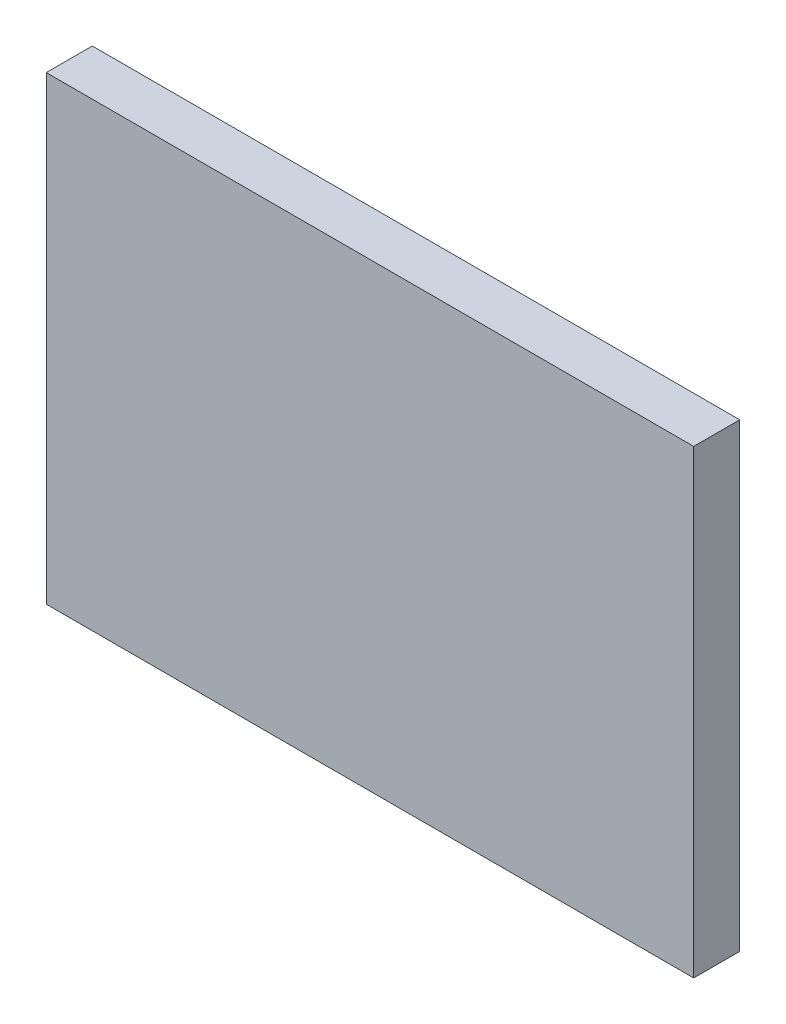
ISO-10303-21;
HEADER;
FILE_DESCRIPTION(('STEP AP214'),'2;1');
FILE_NAME('part.step','',(''),(''),'','','');
FILE_SCHEMA(('AUTOMOTIVE_DESIGN { 1 0 10303 214 1 1 1 1 }'));
ENDSEC;
DATA;
#1=APPLICATION_CONTEXT('core data for automotive mechanical design processes');
#2=APPLICATION_PROTOCOL_DEFINITION('international standard','automotive_design',2000,#1);
#3=PRODUCT_CONTEXT('',#1,'mechanical');
#4=PRODUCT('Part','Part','',(#3));
#5=PRODUCT_RELATED_PRODUCT_CATEGORY('part','',(#4));
#6=PRODUCT_DEFINITION_FORMATION('','',#4);
#7=PRODUCT_DEFINITION_CONTEXT('part definition',#1,'design');
#8=PRODUCT_DEFINITION('design','',#6,#7);
#9=PRODUCT_DEFINITION_SHAPE('','',#8);
#10=(LENGTH_UNIT() NAMED_UNIT(*) SI_UNIT(.MILLI.,.METRE.));
#11=(NAMED_UNIT(*) PLANE_ANGLE_UNIT() SI_UNIT($,.RADIAN.));
#12=(NAMED_UNIT(*) SI_UNIT($,.STERADIAN.) SOLID_ANGLE_UNIT());
#13=UNCERTAINTY_MEASURE_WITH_UNIT(LENGTH_MEASURE(1.E-05),#10,'distance_accuracy_value','');
#14=(GEOMETRIC_REPRESENTATION_CONTEXT(3) GLOBAL_UNCERTAINTY_ASSIGNED_CONTEXT((#13)) GLOBAL_UNIT_ASSIGNED_CONTEXT((#10,
#11,#12)) REPRESENTATION_CONTEXT('',''));
#15=CARTESIAN_POINT('',(0.,0.,0.));
#16=DIRECTION('',(0.,0.,1.));
#17=DIRECTION('',(1.,0.,0.));
#18=AXIS2_PLACEMENT_3D('',#15,#16,#17);
#19=CARTESIAN_POINT('',(11.25,8.,1.6));
#20=DIRECTION('',(-1.,0.,0.));
#21=DIRECTION('',(0.,-1.,0.));
#22=AXIS2_PLACEMENT_3D('',#19,#20,#21);
#23=PLANE('',#22);
#24=DIRECTION('',(0.,1.,0.));
#25=VECTOR('',#24,1.);
#26=CARTESIAN_POINT('',(11.25,8.,0.));
#27=LINE('',#26,#25);
#28=CARTESIAN_POINT('',(11.25,-8.,0.));
#29=VERTEX_POINT('',#28);
#30=CARTESIAN_POINT('',(11.25,8.,0.));
#31=VERTEX_POINT('',#30);
#32=EDGE_CURVE('E96',#29,#31,#27,.T.);
#33=ORIENTED_EDGE('',*,*,#32,.T.);
#34=DIRECTION('',(0.,0.,-1.));
#35=VECTOR('',#34,1.);
#36=CARTESIAN_POINT('',(11.25,8.,1.6));
#37=LINE('',#36,#35);
#38=CARTESIAN_POINT('',(11.25,8.,1.6));
#39=VERTEX_POINT('',#38);
#40=EDGE_CURVE('E11',#39,#31,#37,.T.);
#41=ORIENTED_EDGE('',*,*,#40,.F.);
#42=DIRECTION('',(0.,1.,0.));
#43=VECTOR('',#42,1.);
#44=CARTESIAN_POINT('',(11.25,8.,1.6));
#45=LINE('',#44,#43);
#46=CARTESIAN_POINT('',(11.25,-8.,1.6));
#47=VERTEX_POINT('',#46);
#48=EDGE_CURVE('E84',#47,#39,#45,.T.);
#49=ORIENTED_EDGE('',*,*,#48,.F.);
#50=DIRECTION('',(0.,0.,-1.));
#51=VECTOR('',#50,1.);
#52=CARTESIAN_POINT('',(11.25,-8.,1.6));
#53=LINE('',#52,#51);
#54=EDGE_CURVE('E92',#47,#29,#53,.T.);
#55=ORIENTED_EDGE('',*,*,#54,.T.);
#56=EDGE_LOOP('',(#33,#41,#49,#55));
#57=FACE_BOUND('',#56,.T.);
#58=ADVANCED_FACE('F33',(#57),#23,.F.);
#59=CARTESIAN_POINT('',(-11.25,8.,1.6));
#60=DIRECTION('',(0.,-1.,0.));
#61=DIRECTION('',(0.,0.,-1.));
#62=AXIS2_PLACEMENT_3D('',#59,#60,#61);
#63=PLANE('',#62);
#64=DIRECTION('',(-1.,0.,0.));
#65=VECTOR('',#64,1.);
#66=CARTESIAN_POINT('',(-11.25,8.,0.));
#67=LINE('',#66,#65);
#68=CARTESIAN_POINT('',(-11.25,8.,0.));
#69=VERTEX_POINT('',#68);
#70=EDGE_CURVE('E88',#31,#69,#67,.T.);
#71=ORIENTED_EDGE('',*,*,#70,.T.);
#72=DIRECTION('',(0.,0.,-1.));
#73=VECTOR('',#72,1.);
#74=CARTESIAN_POINT('',(-11.25,8.,1.6));
#75=LINE('',#74,#73);
#76=CARTESIAN_POINT('',(-11.25,8.,1.6));
#77=VERTEX_POINT('',#76);
#78=EDGE_CURVE('E41',#77,#69,#75,.T.);
#79=ORIENTED_EDGE('',*,*,#78,.F.);
#80=DIRECTION('',(-1.,0.,0.));
#81=VECTOR('',#80,1.);
#82=CARTESIAN_POINT('',(-11.25,8.,1.6));
#83=LINE('',#82,#81);
#84=EDGE_CURVE('E79',#39,#77,#83,.T.);
#85=ORIENTED_EDGE('',*,*,#84,.F.);
#86=ORIENTED_EDGE('',*,*,#40,.T.);
#87=EDGE_LOOP('',(#71,#79,#85,#86));
#88=FACE_BOUND('',#87,.T.);
#89=ADVANCED_FACE('F87',(#88),#63,.F.);
#90=CARTESIAN_POINT('',(-11.25,8.,1.6));
#91=DIRECTION('',(1.,0.,0.));
#92=DIRECTION('',(0.,1.,0.));
#93=AXIS2_PLACEMENT_3D('',#90,#91,#92);
#94=PLANE('',#93);
#95=DIRECTION('',(0.,-1.,0.));
#96=VECTOR('',#95,1.);
#97=CARTESIAN_POINT('',(-11.25,8.,0.));
#98=LINE('',#97,#96);
#99=CARTESIAN_POINT('',(-11.25,-8.,0.));
#100=VERTEX_POINT('',#99);
#101=EDGE_CURVE('E66',#69,#100,#98,.T.);
#102=ORIENTED_EDGE('',*,*,#101,.T.);
#103=DIRECTION('',(0.,0.,-1.));
#104=VECTOR('',#103,1.);
#105=CARTESIAN_POINT('',(-11.25,-8.,1.6));
#106=LINE('',#105,#104);
#107=CARTESIAN_POINT('',(-11.25,-8.,1.6));
#108=VERTEX_POINT('',#107);
#109=EDGE_CURVE('E89',#108,#100,#106,.T.);
#110=ORIENTED_EDGE('',*,*,#109,.F.);
#111=DIRECTION('',(0.,-1.,0.));
#112=VECTOR('',#111,1.);
#113=CARTESIAN_POINT('',(-11.25,8.,1.6));
#114=LINE('',#113,#112);
#115=EDGE_CURVE('E82',#77,#108,#114,.T.);
#116=ORIENTED_EDGE('',*,*,#115,.F.);
#117=ORIENTED_EDGE('',*,*,#78,.T.);
#118=EDGE_LOOP('',(#102,#110,#116,#117));
#119=FACE_BOUND('',#118,.T.);
#120=ADVANCED_FACE('F90',(#119),#94,.F.);
#121=CARTESIAN_POINT('',(-11.25,-8.,1.6));
#122=DIRECTION('',(0.,1.,0.));
#123=DIRECTION('',(0.,0.,1.));
#124=AXIS2_PLACEMENT_3D('',#121,#122,#123);
#125=PLANE('',#124);
#126=DIRECTION('',(1.,0.,0.));
#127=VECTOR('',#126,1.);
#128=CARTESIAN_POINT('',(-11.25,-8.,0.));
#129=LINE('',#128,#127);
#130=EDGE_CURVE('E72',#100,#29,#129,.T.);
#131=ORIENTED_EDGE('',*,*,#130,.T.);
#132=ORIENTED_EDGE('',*,*,#54,.F.);
#133=DIRECTION('',(1.,0.,0.));
#134=VECTOR('',#133,1.);
#135=CARTESIAN_POINT('',(-11.25,-8.,1.6));
#136=LINE('',#135,#134);
#137=EDGE_CURVE('E49',#108,#47,#136,.T.);
#138=ORIENTED_EDGE('',*,*,#137,.F.);
#139=ORIENTED_EDGE('',*,*,#109,.T.);
#140=EDGE_LOOP('',(#131,#132,#138,#139));
#141=FACE_BOUND('',#140,.T.);
#142=ADVANCED_FACE('F103',(#141),#125,.F.);
#143=CARTESIAN_POINT('',(0.,0.,1.6));
#144=DIRECTION('',(0.,0.,1.));
#145=DIRECTION('',(1.,0.,0.));
#146=AXIS2_PLACEMENT_3D('',#143,#144,#145);
#147=PLANE('',#146);
#148=ORIENTED_EDGE('',*,*,#48,.T.);
#149=ORIENTED_EDGE('',*,*,#84,.T.);
#150=ORIENTED_EDGE('',*,*,#115,.T.);
#151=ORIENTED_EDGE('',*,*,#137,.T.);
#152=EDGE_LOOP('',(#148,#149,#150,#151));
#153=FACE_BOUND('',#152,.T.);
#154=ADVANCED_FACE('F80',(#153),#147,.T.);
#155=CARTESIAN_POINT('',(0.,0.,0.));
#156=DIRECTION('',(0.,0.,1.));
#157=DIRECTION('',(1.,0.,0.));
#158=AXIS2_PLACEMENT_3D('',#155,#156,#157);
#159=PLANE('',#158);
#160=ORIENTED_EDGE('',*,*,#32,.F.);
#161=ORIENTED_EDGE('',*,*,#130,.F.);
#162=ORIENTED_EDGE('',*,*,#101,.F.);
#163=ORIENTED_EDGE('',*,*,#70,.F.);
#164=EDGE_LOOP('',(#160,#161,#162,#163));
#165=FACE_BOUND('',#164,.T.);
#166=ADVANCED_FACE('F106',(#165),#159,.F.);
#167=CLOSED_SHELL('',(#58,#89,#120,#142,#154,#166));
#168=MANIFOLD_SOLID_BREP('B2',#167);
#169=ADVANCED_BREP_SHAPE_REPRESENTATION('',(#18,#168),#14);
#170=SHAPE_DEFINITION_REPRESENTATION(#9,#169);
ENDSEC;
END-ISO-10303-21;
